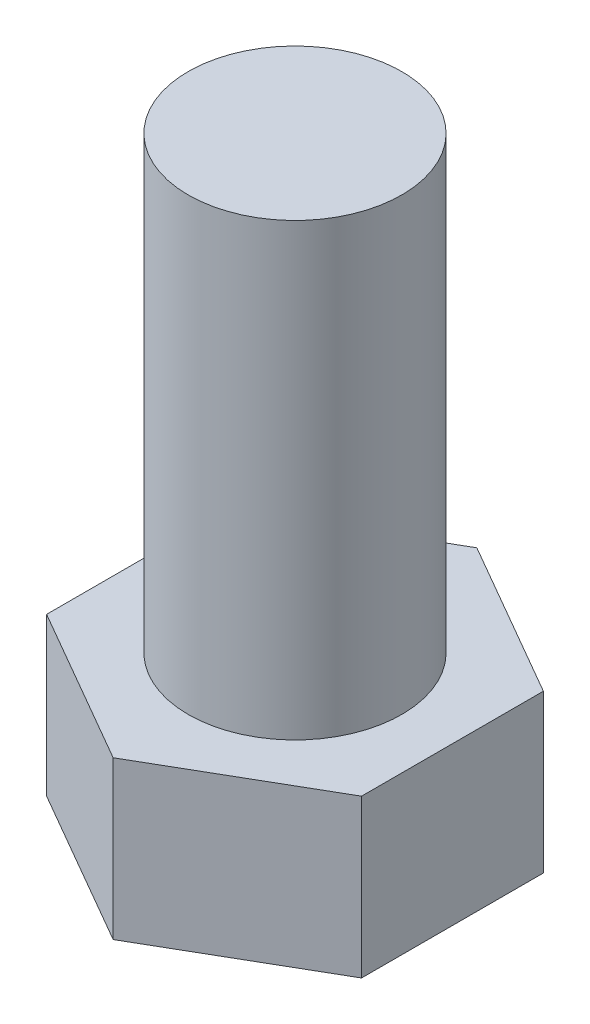
ISO-10303-21;
HEADER;
FILE_DESCRIPTION(('STEP AP214'),'2;1');
FILE_NAME('part.step','',(''),(''),'','','');
FILE_SCHEMA(('AUTOMOTIVE_DESIGN { 1 0 10303 214 1 1 1 1 }'));
ENDSEC;
DATA;
#1=APPLICATION_CONTEXT('core data for automotive mechanical design processes');
#2=APPLICATION_PROTOCOL_DEFINITION('international standard','automotive_design',2000,#1);
#3=PRODUCT_CONTEXT('',#1,'mechanical');
#4=PRODUCT('Part','Part','',(#3));
#5=PRODUCT_RELATED_PRODUCT_CATEGORY('part','',(#4));
#6=PRODUCT_DEFINITION_FORMATION('','',#4);
#7=PRODUCT_DEFINITION_CONTEXT('part definition',#1,'design');
#8=PRODUCT_DEFINITION('design','',#6,#7);
#9=PRODUCT_DEFINITION_SHAPE('','',#8);
#10=(LENGTH_UNIT() NAMED_UNIT(*) SI_UNIT(.MILLI.,.METRE.));
#11=(NAMED_UNIT(*) PLANE_ANGLE_UNIT() SI_UNIT($,.RADIAN.));
#12=(NAMED_UNIT(*) SI_UNIT($,.STERADIAN.) SOLID_ANGLE_UNIT());
#13=UNCERTAINTY_MEASURE_WITH_UNIT(LENGTH_MEASURE(1.E-05),#10,'distance_accuracy_value','');
#14=(GEOMETRIC_REPRESENTATION_CONTEXT(3) GLOBAL_UNCERTAINTY_ASSIGNED_CONTEXT((#13)) GLOBAL_UNIT_ASSIGNED_CONTEXT((#10,
#11,#12)) REPRESENTATION_CONTEXT('',''));
#15=CARTESIAN_POINT('',(0.,0.,0.));
#16=DIRECTION('',(0.,0.,1.));
#17=DIRECTION('',(1.,0.,0.));
#18=AXIS2_PLACEMENT_3D('',#15,#16,#17);
#19=CARTESIAN_POINT('',(0.,7.,0.));
#20=DIRECTION('',(0.,1.,0.));
#21=DIRECTION('',(0.,0.,1.));
#22=AXIS2_PLACEMENT_3D('',#19,#20,#21);
#23=PLANE('',#22);
#24=DIRECTION('',(-0.866025403784438,0.,-0.5));
#25=VECTOR('',#24,1.);
#26=CARTESIAN_POINT('',(7.,7.,-4.04145188432739));
#27=LINE('',#26,#25);
#28=CARTESIAN_POINT('',(7.,7.,-4.04145188432739));
#29=VERTEX_POINT('',#28);
#30=CARTESIAN_POINT('',(0.,7.,-8.08290376865477));
#31=VERTEX_POINT('',#30);
#32=EDGE_CURVE('E131',#29,#31,#27,.T.);
#33=ORIENTED_EDGE('',*,*,#32,.T.);
#34=DIRECTION('',(-0.866025403784439,0.,0.5));
#35=VECTOR('',#34,1.);
#36=CARTESIAN_POINT('',(0.,7.,-8.08290376865477));
#37=LINE('',#36,#35);
#38=CARTESIAN_POINT('',(-7.,7.,-4.04145188432739));
#39=VERTEX_POINT('',#38);
#40=EDGE_CURVE('E89',#31,#39,#37,.T.);
#41=ORIENTED_EDGE('',*,*,#40,.T.);
#42=DIRECTION('',(0.,0.,1.));
#43=VECTOR('',#42,1.);
#44=CARTESIAN_POINT('',(-7.,7.,-4.04145188432739));
#45=LINE('',#44,#43);
#46=CARTESIAN_POINT('',(-7.,7.,4.04145188432738));
#47=VERTEX_POINT('',#46);
#48=EDGE_CURVE('E102',#39,#47,#45,.T.);
#49=ORIENTED_EDGE('',*,*,#48,.T.);
#50=DIRECTION('',(0.866025403784439,0.,0.5));
#51=VECTOR('',#50,1.);
#52=CARTESIAN_POINT('',(-7.,7.,4.04145188432738));
#53=LINE('',#52,#51);
#54=CARTESIAN_POINT('',(0.,7.,8.08290376865476));
#55=VERTEX_POINT('',#54);
#56=EDGE_CURVE('E96',#47,#55,#53,.T.);
#57=ORIENTED_EDGE('',*,*,#56,.T.);
#58=DIRECTION('',(0.866025403784439,0.,-0.5));
#59=VECTOR('',#58,1.);
#60=CARTESIAN_POINT('',(0.,7.,8.08290376865476));
#61=LINE('',#60,#59);
#62=CARTESIAN_POINT('',(7.,7.,4.04145188432738));
#63=VERTEX_POINT('',#62);
#64=EDGE_CURVE('E100',#55,#63,#61,.T.);
#65=ORIENTED_EDGE('',*,*,#64,.T.);
#66=DIRECTION('',(0.,0.,-1.));
#67=VECTOR('',#66,1.);
#68=CARTESIAN_POINT('',(7.,7.,4.04145188432738));
#69=LINE('',#68,#67);
#70=EDGE_CURVE('E52',#63,#29,#69,.T.);
#71=ORIENTED_EDGE('',*,*,#70,.T.);
#72=EDGE_LOOP('',(#33,#41,#49,#57,#65,#71));
#73=FACE_BOUND('',#72,.T.);
#74=CARTESIAN_POINT('',(0.,7.,0.));
#75=DIRECTION('',(0.,1.,0.));
#76=DIRECTION('',(0.,0.,1.));
#77=AXIS2_PLACEMENT_3D('',#74,#75,#76);
#78=CIRCLE('',#77,4.75);
#79=CARTESIAN_POINT('',(0.,7.,4.75));
#80=VERTEX_POINT('',#79);
#81=EDGE_CURVE('E171',#80,#80,#78,.T.);
#82=ORIENTED_EDGE('',*,*,#81,.F.);
#83=EDGE_LOOP('',(#82));
#84=FACE_BOUND('',#83,.T.);
#85=ADVANCED_FACE('F35',(#73,#84),#23,.T.);
#86=CARTESIAN_POINT('',(7.,7.,-4.04145188432739));
#87=DIRECTION('',(-0.5,0.,0.866025403784439));
#88=DIRECTION('',(0.866025403784439,0.,0.5));
#89=AXIS2_PLACEMENT_3D('',#86,#87,#88);
#90=PLANE('',#89);
#91=DIRECTION('',(-0.866025403784438,0.,-0.5));
#92=VECTOR('',#91,1.);
#93=CARTESIAN_POINT('',(7.,0.,-4.04145188432739));
#94=LINE('',#93,#92);
#95=CARTESIAN_POINT('',(7.,0.,-4.04145188432739));
#96=VERTEX_POINT('',#95);
#97=CARTESIAN_POINT('',(0.,0.,-8.08290376865477));
#98=VERTEX_POINT('',#97);
#99=EDGE_CURVE('E120',#96,#98,#94,.T.);
#100=ORIENTED_EDGE('',*,*,#99,.T.);
#101=DIRECTION('',(0.,-1.,0.));
#102=VECTOR('',#101,1.);
#103=CARTESIAN_POINT('',(0.,7.,-8.08290376865477));
#104=LINE('',#103,#102);
#105=EDGE_CURVE('E11',#31,#98,#104,.T.);
#106=ORIENTED_EDGE('',*,*,#105,.F.);
#107=ORIENTED_EDGE('',*,*,#32,.F.);
#108=DIRECTION('',(0.,-1.,0.));
#109=VECTOR('',#108,1.);
#110=CARTESIAN_POINT('',(7.,7.,-4.04145188432739));
#111=LINE('',#110,#109);
#112=EDGE_CURVE('E116',#29,#96,#111,.T.);
#113=ORIENTED_EDGE('',*,*,#112,.T.);
#114=EDGE_LOOP('',(#100,#106,#107,#113));
#115=FACE_BOUND('',#114,.T.);
#116=ADVANCED_FACE('F37',(#115),#90,.F.);
#117=CARTESIAN_POINT('',(0.,7.,-8.08290376865477));
#118=DIRECTION('',(0.5,0.,0.866025403784439));
#119=DIRECTION('',(0.866025403784439,0.,-0.5));
#120=AXIS2_PLACEMENT_3D('',#117,#118,#119);
#121=PLANE('',#120);
#122=DIRECTION('',(-0.866025403784439,0.,0.5));
#123=VECTOR('',#122,1.);
#124=CARTESIAN_POINT('',(0.,0.,-8.08290376865477));
#125=LINE('',#124,#123);
#126=CARTESIAN_POINT('',(-7.,0.,-4.04145188432739));
#127=VERTEX_POINT('',#126);
#128=EDGE_CURVE('E123',#98,#127,#125,.T.);
#129=ORIENTED_EDGE('',*,*,#128,.T.);
#130=DIRECTION('',(0.,-1.,0.));
#131=VECTOR('',#130,1.);
#132=CARTESIAN_POINT('',(-7.,7.,-4.04145188432739));
#133=LINE('',#132,#131);
#134=EDGE_CURVE('E44',#39,#127,#133,.T.);
#135=ORIENTED_EDGE('',*,*,#134,.F.);
#136=ORIENTED_EDGE('',*,*,#40,.F.);
#137=ORIENTED_EDGE('',*,*,#105,.T.);
#138=EDGE_LOOP('',(#129,#135,#136,#137));
#139=FACE_BOUND('',#138,.T.);
#140=ADVANCED_FACE('F159',(#139),#121,.F.);
#141=CARTESIAN_POINT('',(-7.,7.,-4.04145188432739));
#142=DIRECTION('',(1.,0.,0.));
#143=DIRECTION('',(0.,0.,-1.));
#144=AXIS2_PLACEMENT_3D('',#141,#142,#143);
#145=PLANE('',#144);
#146=DIRECTION('',(0.,0.,1.));
#147=VECTOR('',#146,1.);
#148=CARTESIAN_POINT('',(-7.,0.,-4.04145188432739));
#149=LINE('',#148,#147);
#150=CARTESIAN_POINT('',(-7.,0.,4.04145188432738));
#151=VERTEX_POINT('',#150);
#152=EDGE_CURVE('E126',#127,#151,#149,.T.);
#153=ORIENTED_EDGE('',*,*,#152,.T.);
#154=DIRECTION('',(0.,-1.,0.));
#155=VECTOR('',#154,1.);
#156=CARTESIAN_POINT('',(-7.,7.,4.04145188432738));
#157=LINE('',#156,#155);
#158=EDGE_CURVE('E111',#47,#151,#157,.T.);
#159=ORIENTED_EDGE('',*,*,#158,.F.);
#160=ORIENTED_EDGE('',*,*,#48,.F.);
#161=ORIENTED_EDGE('',*,*,#134,.T.);
#162=EDGE_LOOP('',(#153,#159,#160,#161));
#163=FACE_BOUND('',#162,.T.);
#164=ADVANCED_FACE('F137',(#163),#145,.F.);
#165=CARTESIAN_POINT('',(-7.,7.,4.04145188432738));
#166=DIRECTION('',(0.5,0.,-0.866025403784438));
#167=DIRECTION('',(-0.866025403784439,0.,-0.5));
#168=AXIS2_PLACEMENT_3D('',#165,#166,#167);
#169=PLANE('',#168);
#170=DIRECTION('',(0.866025403784439,0.,0.5));
#171=VECTOR('',#170,1.);
#172=CARTESIAN_POINT('',(-7.,0.,4.04145188432738));
#173=LINE('',#172,#171);
#174=CARTESIAN_POINT('',(0.,0.,8.08290376865476));
#175=VERTEX_POINT('',#174);
#176=EDGE_CURVE('E110',#151,#175,#173,.T.);
#177=ORIENTED_EDGE('',*,*,#176,.T.);
#178=DIRECTION('',(0.,-1.,0.));
#179=VECTOR('',#178,1.);
#180=CARTESIAN_POINT('',(0.,7.,8.08290376865476));
#181=LINE('',#180,#179);
#182=EDGE_CURVE('E107',#55,#175,#181,.T.);
#183=ORIENTED_EDGE('',*,*,#182,.F.);
#184=ORIENTED_EDGE('',*,*,#56,.F.);
#185=ORIENTED_EDGE('',*,*,#158,.T.);
#186=EDGE_LOOP('',(#177,#183,#184,#185));
#187=FACE_BOUND('',#186,.T.);
#188=ADVANCED_FACE('F108',(#187),#169,.F.);
#189=CARTESIAN_POINT('',(0.,7.,8.08290376865476));
#190=DIRECTION('',(-0.5,0.,-0.866025403784439));
#191=DIRECTION('',(-0.866025403784439,0.,0.5));
#192=AXIS2_PLACEMENT_3D('',#189,#190,#191);
#193=PLANE('',#192);
#194=DIRECTION('',(0.866025403784439,0.,-0.5));
#195=VECTOR('',#194,1.);
#196=CARTESIAN_POINT('',(0.,0.,8.08290376865476));
#197=LINE('',#196,#195);
#198=CARTESIAN_POINT('',(7.,0.,4.04145188432738));
#199=VERTEX_POINT('',#198);
#200=EDGE_CURVE('E75',#175,#199,#197,.T.);
#201=ORIENTED_EDGE('',*,*,#200,.T.);
#202=DIRECTION('',(0.,-1.,0.));
#203=VECTOR('',#202,1.);
#204=CARTESIAN_POINT('',(7.,7.,4.04145188432738));
#205=LINE('',#204,#203);
#206=EDGE_CURVE('E112',#63,#199,#205,.T.);
#207=ORIENTED_EDGE('',*,*,#206,.F.);
#208=ORIENTED_EDGE('',*,*,#64,.F.);
#209=ORIENTED_EDGE('',*,*,#182,.T.);
#210=EDGE_LOOP('',(#201,#207,#208,#209));
#211=FACE_BOUND('',#210,.T.);
#212=ADVANCED_FACE('F114',(#211),#193,.F.);
#213=CARTESIAN_POINT('',(7.,7.,4.04145188432738));
#214=DIRECTION('',(-1.,0.,0.));
#215=DIRECTION('',(0.,0.,1.));
#216=AXIS2_PLACEMENT_3D('',#213,#214,#215);
#217=PLANE('',#216);
#218=DIRECTION('',(0.,0.,-1.));
#219=VECTOR('',#218,1.);
#220=CARTESIAN_POINT('',(7.,0.,4.04145188432738));
#221=LINE('',#220,#219);
#222=EDGE_CURVE('E81',#199,#96,#221,.T.);
#223=ORIENTED_EDGE('',*,*,#222,.T.);
#224=ORIENTED_EDGE('',*,*,#112,.F.);
#225=ORIENTED_EDGE('',*,*,#70,.F.);
#226=ORIENTED_EDGE('',*,*,#206,.T.);
#227=EDGE_LOOP('',(#223,#224,#225,#226));
#228=FACE_BOUND('',#227,.T.);
#229=ADVANCED_FACE('F144',(#228),#217,.F.);
#230=CARTESIAN_POINT('',(0.,0.,0.));
#231=DIRECTION('',(0.,1.,0.));
#232=DIRECTION('',(0.,0.,1.));
#233=AXIS2_PLACEMENT_3D('',#230,#231,#232);
#234=PLANE('',#233);
#235=ORIENTED_EDGE('',*,*,#99,.F.);
#236=ORIENTED_EDGE('',*,*,#222,.F.);
#237=ORIENTED_EDGE('',*,*,#200,.F.);
#238=ORIENTED_EDGE('',*,*,#176,.F.);
#239=ORIENTED_EDGE('',*,*,#152,.F.);
#240=ORIENTED_EDGE('',*,*,#128,.F.);
#241=EDGE_LOOP('',(#235,#236,#237,#238,#239,#240));
#242=FACE_BOUND('',#241,.T.);
#243=ADVANCED_FACE('F140',(#242),#234,.F.);
#244=CARTESIAN_POINT('',(0.,27.,0.));
#245=DIRECTION('',(0.,-1.,0.));
#246=DIRECTION('',(0.,0.,-1.));
#247=AXIS2_PLACEMENT_3D('',#244,#245,#246);
#248=CYLINDRICAL_SURFACE('',#247,4.75);
#249=CARTESIAN_POINT('',(0.,27.,0.));
#250=DIRECTION('',(0.,1.,0.));
#251=DIRECTION('',(0.,0.,1.));
#252=AXIS2_PLACEMENT_3D('',#249,#250,#251);
#253=CIRCLE('',#252,4.75);
#254=CARTESIAN_POINT('',(0.,27.,4.75));
#255=VERTEX_POINT('',#254);
#256=EDGE_CURVE('E124',#255,#255,#253,.T.);
#257=ORIENTED_EDGE('',*,*,#256,.F.);
#258=EDGE_LOOP('',(#257));
#259=FACE_BOUND('',#258,.T.);
#260=ORIENTED_EDGE('',*,*,#81,.T.);
#261=EDGE_LOOP('',(#260));
#262=FACE_BOUND('',#261,.T.);
#263=ADVANCED_FACE('F151',(#259,#262),#248,.T.);
#264=CARTESIAN_POINT('',(0.,27.,0.));
#265=DIRECTION('',(0.,1.,0.));
#266=DIRECTION('',(0.,0.,1.));
#267=AXIS2_PLACEMENT_3D('',#264,#265,#266);
#268=PLANE('',#267);
#269=ORIENTED_EDGE('',*,*,#256,.T.);
#270=EDGE_LOOP('',(#269));
#271=FACE_BOUND('',#270,.T.);
#272=ADVANCED_FACE('F163',(#271),#268,.T.);
#273=CLOSED_SHELL('',(#85,#116,#140,#164,#188,#212,#229,#243,#263,#272));
#274=MANIFOLD_SOLID_BREP('B2',#273);
#275=ADVANCED_BREP_SHAPE_REPRESENTATION('',(#18,#274),#14);
#276=SHAPE_DEFINITION_REPRESENTATION(#9,#275);
ENDSEC;
END-ISO-10303-21;
